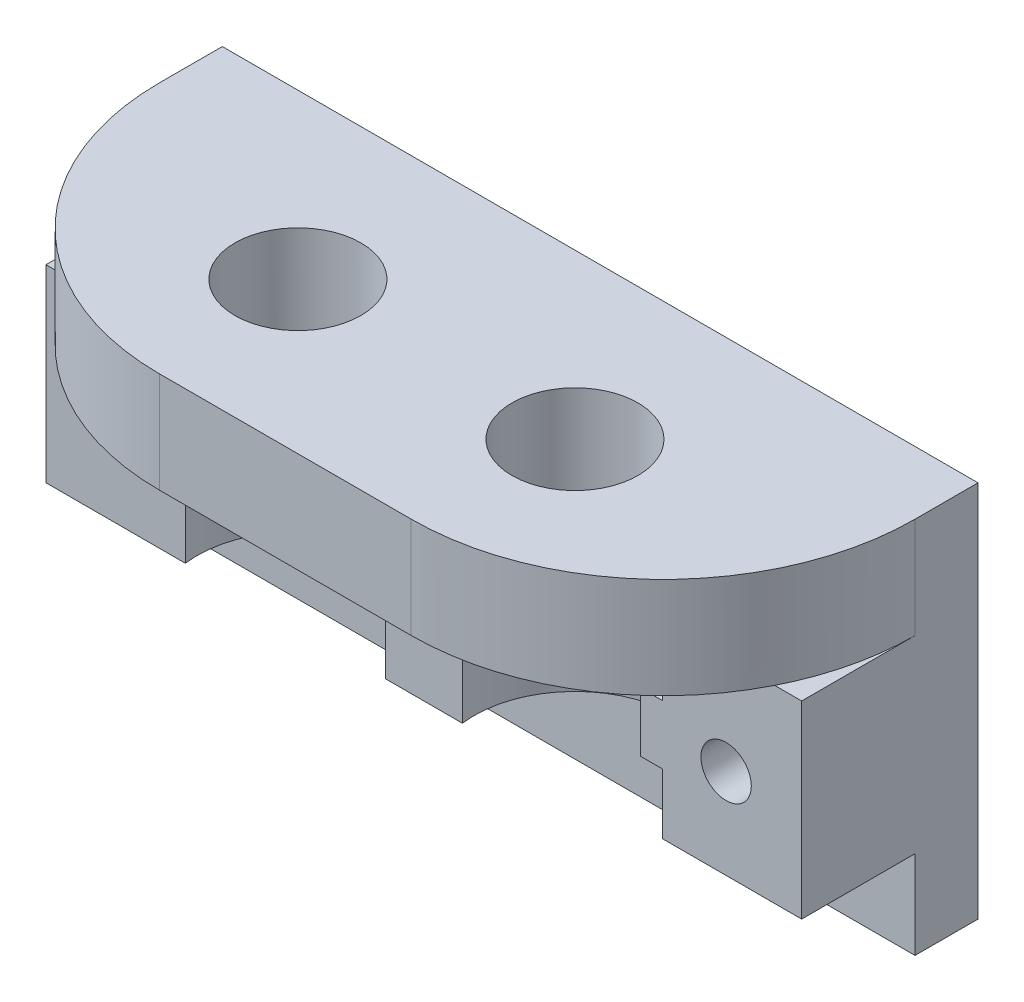
ISO-10303-21;
HEADER;
FILE_DESCRIPTION(('STEP AP214'),'2;1');
FILE_NAME('part.step','',(''),(''),'','','');
FILE_SCHEMA(('AUTOMOTIVE_DESIGN { 1 0 10303 214 1 1 1 1 }'));
ENDSEC;
DATA;
#1=APPLICATION_CONTEXT('core data for automotive mechanical design processes');
#2=APPLICATION_PROTOCOL_DEFINITION('international standard','automotive_design',2000,#1);
#3=PRODUCT_CONTEXT('',#1,'mechanical');
#4=PRODUCT('Part','Part','',(#3));
#5=PRODUCT_RELATED_PRODUCT_CATEGORY('part','',(#4));
#6=PRODUCT_DEFINITION_FORMATION('','',#4);
#7=PRODUCT_DEFINITION_CONTEXT('part definition',#1,'design');
#8=PRODUCT_DEFINITION('design','',#6,#7);
#9=PRODUCT_DEFINITION_SHAPE('','',#8);
#10=(LENGTH_UNIT() NAMED_UNIT(*) SI_UNIT(.MILLI.,.METRE.));
#11=(NAMED_UNIT(*) PLANE_ANGLE_UNIT() SI_UNIT($,.RADIAN.));
#12=(NAMED_UNIT(*) SI_UNIT($,.STERADIAN.) SOLID_ANGLE_UNIT());
#13=UNCERTAINTY_MEASURE_WITH_UNIT(LENGTH_MEASURE(1.E-05),#10,'distance_accuracy_value','');
#14=(GEOMETRIC_REPRESENTATION_CONTEXT(3) GLOBAL_UNCERTAINTY_ASSIGNED_CONTEXT((#13)) GLOBAL_UNIT_ASSIGNED_CONTEXT((#10,
#11,#12)) REPRESENTATION_CONTEXT('',''));
#15=CARTESIAN_POINT('',(0.,0.,0.));
#16=DIRECTION('',(0.,0.,1.));
#17=DIRECTION('',(1.,0.,0.));
#18=AXIS2_PLACEMENT_3D('',#15,#16,#17);
#19=CARTESIAN_POINT('',(-11.,7.,13.));
#20=DIRECTION('',(0.,-1.,0.));
#21=DIRECTION('',(0.,0.,-1.));
#22=AXIS2_PLACEMENT_3D('',#19,#20,#21);
#23=CYLINDRICAL_SURFACE('',#22,8.);
#24=DIRECTION('',(0.,-1.,0.));
#25=VECTOR('',#24,1.);
#26=CARTESIAN_POINT('',(-18.9372539331938,7.,14.));
#27=LINE('',#26,#25);
#28=CARTESIAN_POINT('',(-18.9372539331938,-8.,14.));
#29=VERTEX_POINT('',#28);
#30=CARTESIAN_POINT('',(-18.9372539331938,-3.2,14.));
#31=VERTEX_POINT('',#30);
#32=EDGE_CURVE('E466',#29,#31,#27,.F.);
#33=ORIENTED_EDGE('',*,*,#32,.F.);
#34=CARTESIAN_POINT('',(-11.,-8.,13.));
#35=DIRECTION('',(0.,-1.,0.));
#36=DIRECTION('',(0.,0.,-1.));
#37=AXIS2_PLACEMENT_3D('',#34,#35,#36);
#38=CIRCLE('',#37,8.);
#39=CARTESIAN_POINT('',(-11.,-8.,5.));
#40=VERTEX_POINT('',#39);
#41=EDGE_CURVE('E215',#29,#40,#38,.T.);
#42=ORIENTED_EDGE('',*,*,#41,.T.);
#43=CARTESIAN_POINT('',(-3.06274606680622,-8.,14.));
#44=VERTEX_POINT('',#43);
#45=EDGE_CURVE('E365',#40,#44,#38,.T.);
#46=ORIENTED_EDGE('',*,*,#45,.T.);
#47=DIRECTION('',(0.,-1.,0.));
#48=VECTOR('',#47,1.);
#49=CARTESIAN_POINT('',(-3.06274606680622,7.,14.));
#50=LINE('',#49,#48);
#51=CARTESIAN_POINT('',(-3.06274606680622,-3.2,14.));
#52=VERTEX_POINT('',#51);
#53=EDGE_CURVE('E453',#52,#44,#50,.T.);
#54=ORIENTED_EDGE('',*,*,#53,.F.);
#55=CARTESIAN_POINT('',(-11.,-3.2,13.));
#56=DIRECTION('',(0.,-1.,0.));
#57=DIRECTION('',(0.,0.,-1.));
#58=AXIS2_PLACEMENT_3D('',#55,#56,#57);
#59=CIRCLE('',#58,8.);
#60=EDGE_CURVE('E370',#52,#31,#59,.F.);
#61=ORIENTED_EDGE('',*,*,#60,.T.);
#62=EDGE_LOOP('',(#33,#42,#46,#54,#61));
#63=FACE_BOUND('',#62,.T.);
#64=ADVANCED_FACE('F34',(#63),#23,.F.);
#65=CARTESIAN_POINT('',(11.,7.,13.));
#66=DIRECTION('',(0.,-1.,0.));
#67=DIRECTION('',(0.,0.,-1.));
#68=AXIS2_PLACEMENT_3D('',#65,#66,#67);
#69=CYLINDRICAL_SURFACE('',#68,8.);
#70=DIRECTION('',(0.,-1.,0.));
#71=VECTOR('',#70,1.);
#72=CARTESIAN_POINT('',(3.06274606680622,7.,14.));
#73=LINE('',#72,#71);
#74=CARTESIAN_POINT('',(3.06274606680623,-8.,14.));
#75=VERTEX_POINT('',#74);
#76=CARTESIAN_POINT('',(3.06274606680622,-3.2,14.));
#77=VERTEX_POINT('',#76);
#78=EDGE_CURVE('E305',#75,#77,#73,.F.);
#79=ORIENTED_EDGE('',*,*,#78,.F.);
#80=CARTESIAN_POINT('',(11.,-8.,13.));
#81=DIRECTION('',(0.,-1.,0.));
#82=DIRECTION('',(0.,0.,1.));
#83=AXIS2_PLACEMENT_3D('',#80,#81,#82);
#84=CIRCLE('',#83,8.);
#85=CARTESIAN_POINT('',(11.,-8.,5.));
#86=VERTEX_POINT('',#85);
#87=EDGE_CURVE('E363',#75,#86,#84,.T.);
#88=ORIENTED_EDGE('',*,*,#87,.T.);
#89=CARTESIAN_POINT('',(18.9372539331938,-8.,14.));
#90=VERTEX_POINT('',#89);
#91=EDGE_CURVE('E367',#86,#90,#84,.T.);
#92=ORIENTED_EDGE('',*,*,#91,.T.);
#93=DIRECTION('',(0.,-1.,0.));
#94=VECTOR('',#93,1.);
#95=CARTESIAN_POINT('',(18.9372539331938,7.,14.));
#96=LINE('',#95,#94);
#97=CARTESIAN_POINT('',(18.9372539331938,-3.2,14.));
#98=VERTEX_POINT('',#97);
#99=EDGE_CURVE('E308',#98,#90,#96,.T.);
#100=ORIENTED_EDGE('',*,*,#99,.F.);
#101=CARTESIAN_POINT('',(11.,-3.2,13.));
#102=DIRECTION('',(0.,-1.,0.));
#103=DIRECTION('',(0.,0.,-1.));
#104=AXIS2_PLACEMENT_3D('',#101,#102,#103);
#105=CIRCLE('',#104,8.);
#106=EDGE_CURVE('E44',#98,#77,#105,.F.);
#107=ORIENTED_EDGE('',*,*,#106,.T.);
#108=EDGE_LOOP('',(#79,#88,#92,#100,#107));
#109=FACE_BOUND('',#108,.T.);
#110=ADVANCED_FACE('F304',(#109),#69,.F.);
#111=CARTESIAN_POINT('',(-30.,-8.,15.));
#112=DIRECTION('',(0.,1.,0.));
#113=DIRECTION('',(-1.,0.,0.));
#114=AXIS2_PLACEMENT_3D('',#111,#112,#113);
#115=PLANE('',#114);
#116=DIRECTION('',(1.,0.,0.));
#117=VECTOR('',#116,1.);
#118=CARTESIAN_POINT('',(-30.,-8.,14.));
#119=LINE('',#118,#117);
#120=CARTESIAN_POINT('',(30.,-8.,14.));
#121=VERTEX_POINT('',#120);
#122=EDGE_CURVE('E207',#90,#121,#119,.T.);
#123=ORIENTED_EDGE('',*,*,#122,.F.);
#124=ORIENTED_EDGE('',*,*,#91,.F.);
#125=DIRECTION('',(1.,0.,0.));
#126=VECTOR('',#125,1.);
#127=CARTESIAN_POINT('',(-30.,-8.,5.));
#128=LINE('',#127,#126);
#129=CARTESIAN_POINT('',(30.,-8.,5.));
#130=VERTEX_POINT('',#129);
#131=EDGE_CURVE('E374',#86,#130,#128,.T.);
#132=ORIENTED_EDGE('',*,*,#131,.T.);
#133=DIRECTION('',(0.,0.,-1.));
#134=VECTOR('',#133,1.);
#135=CARTESIAN_POINT('',(30.,-8.,15.));
#136=LINE('',#135,#134);
#137=EDGE_CURVE('E224',#121,#130,#136,.T.);
#138=ORIENTED_EDGE('',*,*,#137,.F.);
#139=EDGE_LOOP('',(#123,#124,#132,#138));
#140=FACE_BOUND('',#139,.T.);
#141=ADVANCED_FACE('F384',(#140),#115,.F.);
#142=EDGE_CURVE('E217',#44,#75,#119,.T.);
#143=ORIENTED_EDGE('',*,*,#142,.F.);
#144=ORIENTED_EDGE('',*,*,#45,.F.);
#145=EDGE_CURVE('E376',#40,#86,#128,.T.);
#146=ORIENTED_EDGE('',*,*,#145,.T.);
#147=ORIENTED_EDGE('',*,*,#87,.F.);
#148=EDGE_LOOP('',(#143,#144,#146,#147));
#149=FACE_BOUND('',#148,.T.);
#150=ADVANCED_FACE('F489',(#149),#115,.F.);
#151=CARTESIAN_POINT('',(30.,15.,5.));
#152=DIRECTION('',(-1.,0.,0.));
#153=DIRECTION('',(0.,-1.,0.));
#154=AXIS2_PLACEMENT_3D('',#151,#152,#153);
#155=PLANE('',#154);
#156=DIRECTION('',(0.,1.,0.));
#157=VECTOR('',#156,1.);
#158=CARTESIAN_POINT('',(30.,7.,14.));
#159=LINE('',#158,#157);
#160=CARTESIAN_POINT('',(30.,7.,14.));
#161=VERTEX_POINT('',#160);
#162=EDGE_CURVE('E216',#121,#161,#159,.T.);
#163=ORIENTED_EDGE('',*,*,#162,.F.);
#164=ORIENTED_EDGE('',*,*,#137,.T.);
#165=DIRECTION('',(0.,1.,0.));
#166=VECTOR('',#165,1.);
#167=CARTESIAN_POINT('',(30.,15.,5.));
#168=LINE('',#167,#166);
#169=CARTESIAN_POINT('',(30.,-15.,5.));
#170=VERTEX_POINT('',#169);
#171=EDGE_CURVE('E252',#170,#130,#168,.T.);
#172=ORIENTED_EDGE('',*,*,#171,.F.);
#173=DIRECTION('',(0.,0.,-1.));
#174=VECTOR('',#173,1.);
#175=CARTESIAN_POINT('',(30.,-15.,5.));
#176=LINE('',#175,#174);
#177=CARTESIAN_POINT('',(30.,-15.,0.));
#178=VERTEX_POINT('',#177);
#179=EDGE_CURVE('E396',#170,#178,#176,.T.);
#180=ORIENTED_EDGE('',*,*,#179,.T.);
#181=DIRECTION('',(0.,1.,0.));
#182=VECTOR('',#181,1.);
#183=CARTESIAN_POINT('',(30.,15.,0.));
#184=LINE('',#183,#182);
#185=CARTESIAN_POINT('',(30.,15.,0.));
#186=VERTEX_POINT('',#185);
#187=EDGE_CURVE('E246',#178,#186,#184,.T.);
#188=ORIENTED_EDGE('',*,*,#187,.T.);
#189=DIRECTION('',(0.,0.,-1.));
#190=VECTOR('',#189,1.);
#191=CARTESIAN_POINT('',(30.,15.,5.));
#192=LINE('',#191,#190);
#193=CARTESIAN_POINT('',(30.,15.,5.));
#194=VERTEX_POINT('',#193);
#195=EDGE_CURVE('E257',#194,#186,#192,.T.);
#196=ORIENTED_EDGE('',*,*,#195,.F.);
#197=DIRECTION('',(0.,1.,0.));
#198=VECTOR('',#197,1.);
#199=CARTESIAN_POINT('',(30.,7.,5.));
#200=LINE('',#199,#198);
#201=CARTESIAN_POINT('',(30.,7.,5.));
#202=VERTEX_POINT('',#201);
#203=EDGE_CURVE('E269',#194,#202,#200,.F.);
#204=ORIENTED_EDGE('',*,*,#203,.T.);
#205=DIRECTION('',(0.,0.,-1.));
#206=VECTOR('',#205,1.);
#207=CARTESIAN_POINT('',(30.,7.,15.));
#208=LINE('',#207,#206);
#209=EDGE_CURVE('E38',#161,#202,#208,.T.);
#210=ORIENTED_EDGE('',*,*,#209,.F.);
#211=EDGE_LOOP('',(#163,#164,#172,#180,#188,#196,#204,#210));
#212=FACE_BOUND('',#211,.T.);
#213=ADVANCED_FACE('F394',(#212),#155,.F.);
#214=CARTESIAN_POINT('',(-30.,15.,5.));
#215=DIRECTION('',(1.,0.,0.));
#216=DIRECTION('',(0.,1.,0.));
#217=AXIS2_PLACEMENT_3D('',#214,#215,#216);
#218=PLANE('',#217);
#219=DIRECTION('',(0.,-1.,0.));
#220=VECTOR('',#219,1.);
#221=CARTESIAN_POINT('',(-30.,7.,14.));
#222=LINE('',#221,#220);
#223=CARTESIAN_POINT('',(-30.,7.,14.));
#224=VERTEX_POINT('',#223);
#225=CARTESIAN_POINT('',(-30.,-8.,14.));
#226=VERTEX_POINT('',#225);
#227=EDGE_CURVE('E196',#224,#226,#222,.T.);
#228=ORIENTED_EDGE('',*,*,#227,.F.);
#229=DIRECTION('',(0.,0.,-1.));
#230=VECTOR('',#229,1.);
#231=CARTESIAN_POINT('',(-30.,7.,15.));
#232=LINE('',#231,#230);
#233=CARTESIAN_POINT('',(-30.,7.,5.));
#234=VERTEX_POINT('',#233);
#235=EDGE_CURVE('E287',#224,#234,#232,.T.);
#236=ORIENTED_EDGE('',*,*,#235,.T.);
#237=DIRECTION('',(0.,-1.,0.));
#238=VECTOR('',#237,1.);
#239=CARTESIAN_POINT('',(-30.,15.,5.));
#240=LINE('',#239,#238);
#241=CARTESIAN_POINT('',(-30.,15.,5.));
#242=VERTEX_POINT('',#241);
#243=EDGE_CURVE('E298',#234,#242,#240,.F.);
#244=ORIENTED_EDGE('',*,*,#243,.T.);
#245=DIRECTION('',(0.,0.,-1.));
#246=VECTOR('',#245,1.);
#247=CARTESIAN_POINT('',(-30.,15.,5.));
#248=LINE('',#247,#246);
#249=CARTESIAN_POINT('',(-30.,15.,0.));
#250=VERTEX_POINT('',#249);
#251=EDGE_CURVE('E421',#242,#250,#248,.T.);
#252=ORIENTED_EDGE('',*,*,#251,.T.);
#253=DIRECTION('',(0.,-1.,0.));
#254=VECTOR('',#253,1.);
#255=CARTESIAN_POINT('',(-30.,15.,0.));
#256=LINE('',#255,#254);
#257=CARTESIAN_POINT('',(-30.,-15.,0.));
#258=VERTEX_POINT('',#257);
#259=EDGE_CURVE('E429',#250,#258,#256,.T.);
#260=ORIENTED_EDGE('',*,*,#259,.T.);
#261=DIRECTION('',(0.,0.,-1.));
#262=VECTOR('',#261,1.);
#263=CARTESIAN_POINT('',(-30.,-15.,5.));
#264=LINE('',#263,#262);
#265=CARTESIAN_POINT('',(-30.,-15.,5.));
#266=VERTEX_POINT('',#265);
#267=EDGE_CURVE('E422',#266,#258,#264,.T.);
#268=ORIENTED_EDGE('',*,*,#267,.F.);
#269=DIRECTION('',(0.,-1.,0.));
#270=VECTOR('',#269,1.);
#271=CARTESIAN_POINT('',(-30.,15.,5.));
#272=LINE('',#271,#270);
#273=CARTESIAN_POINT('',(-30.,-8.,5.));
#274=VERTEX_POINT('',#273);
#275=EDGE_CURVE('E222',#274,#266,#272,.T.);
#276=ORIENTED_EDGE('',*,*,#275,.F.);
#277=DIRECTION('',(0.,0.,-1.));
#278=VECTOR('',#277,1.);
#279=CARTESIAN_POINT('',(-30.,-8.,15.));
#280=LINE('',#279,#278);
#281=EDGE_CURVE('E213',#226,#274,#280,.T.);
#282=ORIENTED_EDGE('',*,*,#281,.F.);
#283=EDGE_LOOP('',(#228,#236,#244,#252,#260,#268,#276,#282));
#284=FACE_BOUND('',#283,.T.);
#285=ADVANCED_FACE('F220',(#284),#218,.F.);
#286=CARTESIAN_POINT('',(-30.,7.,15.));
#287=DIRECTION('',(0.,-1.,0.));
#288=DIRECTION('',(0.,0.,-1.));
#289=AXIS2_PLACEMENT_3D('',#286,#287,#288);
#290=PLANE('',#289);
#291=DIRECTION('',(-1.,0.,0.));
#292=VECTOR('',#291,1.);
#293=CARTESIAN_POINT('',(-30.,7.,14.));
#294=LINE('',#293,#292);
#295=CARTESIAN_POINT('',(27.8605710994918,7.,14.));
#296=VERTEX_POINT('',#295);
#297=EDGE_CURVE('E337',#161,#296,#294,.T.);
#298=ORIENTED_EDGE('',*,*,#297,.F.);
#299=ORIENTED_EDGE('',*,*,#209,.T.);
#300=CARTESIAN_POINT('',(9.99999999999999,7.,5.));
#301=DIRECTION('',(0.,1.,0.));
#302=DIRECTION('',(0.,0.,1.));
#303=AXIS2_PLACEMENT_3D('',#300,#301,#302);
#304=CIRCLE('',#303,20.);
#305=EDGE_CURVE('E280',#202,#296,#304,.F.);
#306=ORIENTED_EDGE('',*,*,#305,.T.);
#307=EDGE_LOOP('',(#298,#299,#306));
#308=FACE_BOUND('',#307,.T.);
#309=ADVANCED_FACE('F403',(#308),#290,.F.);
#310=EDGE_CURVE('E199',#226,#29,#119,.T.);
#311=ORIENTED_EDGE('',*,*,#310,.F.);
#312=ORIENTED_EDGE('',*,*,#281,.T.);
#313=EDGE_CURVE('E289',#274,#40,#128,.T.);
#314=ORIENTED_EDGE('',*,*,#313,.T.);
#315=ORIENTED_EDGE('',*,*,#41,.F.);
#316=EDGE_LOOP('',(#311,#312,#314,#315));
#317=FACE_BOUND('',#316,.T.);
#318=ADVANCED_FACE('F211',(#317),#115,.F.);
#319=CARTESIAN_POINT('',(-27.8605710994918,7.,14.));
#320=VERTEX_POINT('',#319);
#321=EDGE_CURVE('E203',#320,#224,#294,.T.);
#322=ORIENTED_EDGE('',*,*,#321,.F.);
#323=CARTESIAN_POINT('',(-10.,7.,5.));
#324=DIRECTION('',(0.,1.,0.));
#325=DIRECTION('',(0.,0.,1.));
#326=AXIS2_PLACEMENT_3D('',#323,#324,#325);
#327=CIRCLE('',#326,20.);
#328=EDGE_CURVE('E272',#320,#234,#327,.F.);
#329=ORIENTED_EDGE('',*,*,#328,.T.);
#330=ORIENTED_EDGE('',*,*,#235,.F.);
#331=EDGE_LOOP('',(#322,#329,#330));
#332=FACE_BOUND('',#331,.T.);
#333=ADVANCED_FACE('F528',(#332),#290,.F.);
#334=DIRECTION('',(0.,-1.,0.));
#335=VECTOR('',#334,1.);
#336=CARTESIAN_POINT('',(-18.9372539331938,7.,14.));
#337=LINE('',#336,#335);
#338=CARTESIAN_POINT('',(-18.9372539331938,1.5,14.));
#339=VERTEX_POINT('',#338);
#340=CARTESIAN_POINT('',(-18.9372539331938,7.,14.));
#341=VERTEX_POINT('',#340);
#342=EDGE_CURVE('E448',#339,#341,#337,.F.);
#343=ORIENTED_EDGE('',*,*,#342,.F.);
#344=CARTESIAN_POINT('',(-11.,1.5,13.));
#345=DIRECTION('',(0.,1.,0.));
#346=DIRECTION('',(0.,0.,1.));
#347=AXIS2_PLACEMENT_3D('',#344,#345,#346);
#348=CIRCLE('',#347,8.);
#349=CARTESIAN_POINT('',(-3.06274606680622,1.5,14.));
#350=VERTEX_POINT('',#349);
#351=EDGE_CURVE('E451',#339,#350,#348,.F.);
#352=ORIENTED_EDGE('',*,*,#351,.T.);
#353=DIRECTION('',(0.,-1.,0.));
#354=VECTOR('',#353,1.);
#355=CARTESIAN_POINT('',(-3.06274606680622,7.,14.));
#356=LINE('',#355,#354);
#357=CARTESIAN_POINT('',(-3.06274606680622,7.,14.));
#358=VERTEX_POINT('',#357);
#359=EDGE_CURVE('E450',#358,#350,#356,.T.);
#360=ORIENTED_EDGE('',*,*,#359,.F.);
#361=CARTESIAN_POINT('',(-11.,7.,13.));
#362=DIRECTION('',(0.,-1.,0.));
#363=DIRECTION('',(0.,0.,-1.));
#364=AXIS2_PLACEMENT_3D('',#361,#362,#363);
#365=CIRCLE('',#364,8.);
#366=EDGE_CURVE('E373',#341,#358,#365,.T.);
#367=ORIENTED_EDGE('',*,*,#366,.F.);
#368=EDGE_LOOP('',(#343,#352,#360,#367));
#369=FACE_BOUND('',#368,.T.);
#370=ADVANCED_FACE('F446',(#369),#23,.F.);
#371=DIRECTION('',(0.,-1.,0.));
#372=VECTOR('',#371,1.);
#373=CARTESIAN_POINT('',(3.06274606680622,7.,14.));
#374=LINE('',#373,#372);
#375=CARTESIAN_POINT('',(3.06274606680622,1.5,14.));
#376=VERTEX_POINT('',#375);
#377=CARTESIAN_POINT('',(3.06274606680623,7.,14.));
#378=VERTEX_POINT('',#377);
#379=EDGE_CURVE('E320',#376,#378,#374,.F.);
#380=ORIENTED_EDGE('',*,*,#379,.F.);
#381=CARTESIAN_POINT('',(11.,1.5,13.));
#382=DIRECTION('',(0.,1.,0.));
#383=DIRECTION('',(0.,0.,1.));
#384=AXIS2_PLACEMENT_3D('',#381,#382,#383);
#385=CIRCLE('',#384,8.);
#386=CARTESIAN_POINT('',(18.9372539331938,1.5,14.));
#387=VERTEX_POINT('',#386);
#388=EDGE_CURVE('E295',#376,#387,#385,.F.);
#389=ORIENTED_EDGE('',*,*,#388,.T.);
#390=DIRECTION('',(0.,-1.,0.));
#391=VECTOR('',#390,1.);
#392=CARTESIAN_POINT('',(18.9372539331938,7.,14.));
#393=LINE('',#392,#391);
#394=CARTESIAN_POINT('',(18.9372539331938,7.,14.));
#395=VERTEX_POINT('',#394);
#396=EDGE_CURVE('E327',#395,#387,#393,.T.);
#397=ORIENTED_EDGE('',*,*,#396,.F.);
#398=CARTESIAN_POINT('',(11.,7.,13.));
#399=DIRECTION('',(0.,-1.,0.));
#400=DIRECTION('',(0.,0.,1.));
#401=AXIS2_PLACEMENT_3D('',#398,#399,#400);
#402=CIRCLE('',#401,8.);
#403=EDGE_CURVE('E358',#378,#395,#402,.T.);
#404=ORIENTED_EDGE('',*,*,#403,.F.);
#405=EDGE_LOOP('',(#380,#389,#397,#404));
#406=FACE_BOUND('',#405,.T.);
#407=ADVANCED_FACE('F357',(#406),#69,.F.);
#408=CARTESIAN_POINT('',(-30.,1.5,-55.1838018074631));
#409=DIRECTION('',(0.,1.,0.));
#410=DIRECTION('',(0.,0.,1.));
#411=AXIS2_PLACEMENT_3D('',#408,#409,#410);
#412=PLANE('',#411);
#413=ORIENTED_EDGE('',*,*,#388,.F.);
#414=DIRECTION('',(1.,0.,0.));
#415=VECTOR('',#414,1.);
#416=CARTESIAN_POINT('',(-30.,1.5,14.));
#417=LINE('',#416,#415);
#418=CARTESIAN_POINT('',(4.7798713839664,1.5,14.));
#419=VERTEX_POINT('',#418);
#420=EDGE_CURVE('E316',#376,#419,#417,.T.);
#421=ORIENTED_EDGE('',*,*,#420,.T.);
#422=CARTESIAN_POINT('',(11.,1.5,13.));
#423=DIRECTION('',(0.,1.,0.));
#424=DIRECTION('',(0.,0.,1.));
#425=AXIS2_PLACEMENT_3D('',#422,#423,#424);
#426=CIRCLE('',#425,6.3);
#427=CARTESIAN_POINT('',(17.2201286160336,1.5,14.));
#428=VERTEX_POINT('',#427);
#429=EDGE_CURVE('E478',#428,#419,#426,.T.);
#430=ORIENTED_EDGE('',*,*,#429,.F.);
#431=EDGE_CURVE('E322',#428,#387,#417,.T.);
#432=ORIENTED_EDGE('',*,*,#431,.T.);
#433=EDGE_LOOP('',(#413,#421,#430,#432));
#434=FACE_BOUND('',#433,.T.);
#435=ADVANCED_FACE('F509',(#434),#412,.T.);
#436=CARTESIAN_POINT('',(-30.,-3.2,-55.1838018074631));
#437=DIRECTION('',(0.,-1.,0.));
#438=DIRECTION('',(0.,0.,-1.));
#439=AXIS2_PLACEMENT_3D('',#436,#437,#438);
#440=PLANE('',#439);
#441=ORIENTED_EDGE('',*,*,#106,.F.);
#442=DIRECTION('',(-1.,0.,0.));
#443=VECTOR('',#442,1.);
#444=CARTESIAN_POINT('',(-30.,-3.2,14.));
#445=LINE('',#444,#443);
#446=CARTESIAN_POINT('',(17.2201286160336,-3.2,14.));
#447=VERTEX_POINT('',#446);
#448=EDGE_CURVE('E313',#98,#447,#445,.T.);
#449=ORIENTED_EDGE('',*,*,#448,.T.);
#450=CARTESIAN_POINT('',(11.,-3.2,13.));
#451=DIRECTION('',(0.,-1.,0.));
#452=DIRECTION('',(0.,0.,1.));
#453=AXIS2_PLACEMENT_3D('',#450,#451,#452);
#454=CIRCLE('',#453,6.3);
#455=CARTESIAN_POINT('',(4.7798713839664,-3.2,14.));
#456=VERTEX_POINT('',#455);
#457=EDGE_CURVE('E315',#456,#447,#454,.T.);
#458=ORIENTED_EDGE('',*,*,#457,.F.);
#459=EDGE_CURVE('E60',#456,#77,#445,.T.);
#460=ORIENTED_EDGE('',*,*,#459,.T.);
#461=EDGE_LOOP('',(#441,#449,#458,#460));
#462=FACE_BOUND('',#461,.T.);
#463=ADVANCED_FACE('F311',(#462),#440,.T.);
#464=ORIENTED_EDGE('',*,*,#60,.F.);
#465=DIRECTION('',(-1.,0.,0.));
#466=VECTOR('',#465,1.);
#467=CARTESIAN_POINT('',(-30.,-3.2,14.));
#468=LINE('',#467,#466);
#469=CARTESIAN_POINT('',(-4.7798713839664,-3.2,14.));
#470=VERTEX_POINT('',#469);
#471=EDGE_CURVE('E454',#52,#470,#468,.T.);
#472=ORIENTED_EDGE('',*,*,#471,.T.);
#473=CARTESIAN_POINT('',(-11.,-3.2,13.));
#474=DIRECTION('',(0.,-1.,0.));
#475=DIRECTION('',(0.,0.,-1.));
#476=AXIS2_PLACEMENT_3D('',#473,#474,#475);
#477=CIRCLE('',#476,6.3);
#478=CARTESIAN_POINT('',(-17.2201286160336,-3.2,14.));
#479=VERTEX_POINT('',#478);
#480=EDGE_CURVE('E481',#479,#470,#477,.T.);
#481=ORIENTED_EDGE('',*,*,#480,.F.);
#482=EDGE_CURVE('E52',#479,#31,#468,.T.);
#483=ORIENTED_EDGE('',*,*,#482,.T.);
#484=EDGE_LOOP('',(#464,#472,#481,#483));
#485=FACE_BOUND('',#484,.T.);
#486=ADVANCED_FACE('F493',(#485),#440,.T.);
#487=ORIENTED_EDGE('',*,*,#351,.F.);
#488=DIRECTION('',(1.,0.,0.));
#489=VECTOR('',#488,1.);
#490=CARTESIAN_POINT('',(-30.,1.5,14.));
#491=LINE('',#490,#489);
#492=CARTESIAN_POINT('',(-17.2201286160336,1.5,14.));
#493=VERTEX_POINT('',#492);
#494=EDGE_CURVE('E464',#339,#493,#491,.T.);
#495=ORIENTED_EDGE('',*,*,#494,.T.);
#496=CARTESIAN_POINT('',(-11.,1.5,13.));
#497=DIRECTION('',(0.,1.,0.));
#498=DIRECTION('',(0.,0.,1.));
#499=AXIS2_PLACEMENT_3D('',#496,#497,#498);
#500=CIRCLE('',#499,6.3);
#501=CARTESIAN_POINT('',(-4.7798713839664,1.5,14.));
#502=VERTEX_POINT('',#501);
#503=EDGE_CURVE('E11',#502,#493,#500,.T.);
#504=ORIENTED_EDGE('',*,*,#503,.F.);
#505=EDGE_CURVE('E459',#502,#350,#491,.T.);
#506=ORIENTED_EDGE('',*,*,#505,.T.);
#507=EDGE_LOOP('',(#487,#495,#504,#506));
#508=FACE_BOUND('',#507,.T.);
#509=ADVANCED_FACE('F506',(#508),#412,.T.);
#510=CARTESIAN_POINT('',(-11.,1.8,13.));
#511=DIRECTION('',(0.,-1.,0.));
#512=DIRECTION('',(0.,0.,-1.));
#513=AXIS2_PLACEMENT_3D('',#510,#511,#512);
#514=CYLINDRICAL_SURFACE('',#513,6.3);
#515=DIRECTION('',(0.,-1.,0.));
#516=VECTOR('',#515,1.);
#517=CARTESIAN_POINT('',(-17.2201286160336,1.8,14.));
#518=LINE('',#517,#516);
#519=EDGE_CURVE('E456',#479,#493,#518,.F.);
#520=ORIENTED_EDGE('',*,*,#519,.F.);
#521=ORIENTED_EDGE('',*,*,#480,.T.);
#522=DIRECTION('',(0.,-1.,0.));
#523=VECTOR('',#522,1.);
#524=CARTESIAN_POINT('',(-4.7798713839664,1.8,14.));
#525=LINE('',#524,#523);
#526=EDGE_CURVE('E498',#502,#470,#525,.T.);
#527=ORIENTED_EDGE('',*,*,#526,.F.);
#528=ORIENTED_EDGE('',*,*,#503,.T.);
#529=EDGE_LOOP('',(#520,#521,#527,#528));
#530=FACE_BOUND('',#529,.T.);
#531=ADVANCED_FACE('F505',(#530),#514,.F.);
#532=CARTESIAN_POINT('',(11.,1.8,13.));
#533=DIRECTION('',(0.,-1.,0.));
#534=DIRECTION('',(0.,0.,-1.));
#535=AXIS2_PLACEMENT_3D('',#532,#533,#534);
#536=CYLINDRICAL_SURFACE('',#535,6.3);
#537=DIRECTION('',(0.,-1.,0.));
#538=VECTOR('',#537,1.);
#539=CARTESIAN_POINT('',(4.7798713839664,1.8,14.));
#540=LINE('',#539,#538);
#541=EDGE_CURVE('E317',#456,#419,#540,.F.);
#542=ORIENTED_EDGE('',*,*,#541,.F.);
#543=ORIENTED_EDGE('',*,*,#457,.T.);
#544=DIRECTION('',(0.,-1.,0.));
#545=VECTOR('',#544,1.);
#546=CARTESIAN_POINT('',(17.2201286160336,1.8,14.));
#547=LINE('',#546,#545);
#548=EDGE_CURVE('E325',#428,#447,#547,.T.);
#549=ORIENTED_EDGE('',*,*,#548,.F.);
#550=ORIENTED_EDGE('',*,*,#429,.T.);
#551=EDGE_LOOP('',(#542,#543,#549,#550));
#552=FACE_BOUND('',#551,.T.);
#553=ADVANCED_FACE('F514',(#552),#536,.F.);
#554=CARTESIAN_POINT('',(0.,-0.850000000000002,0.));
#555=DIRECTION('',(0.,0.,1.));
#556=DIRECTION('',(1.,0.,0.));
#557=AXIS2_PLACEMENT_3D('',#554,#555,#556);
#558=CYLINDRICAL_SURFACE('',#557,2.);
#559=CARTESIAN_POINT('',(0.,-0.850000000000002,0.));
#560=DIRECTION('',(0.,0.,1.));
#561=DIRECTION('',(1.,0.,0.));
#562=AXIS2_PLACEMENT_3D('',#559,#560,#561);
#563=CIRCLE('',#562,2.);
#564=CARTESIAN_POINT('',(2.,-0.850000000000002,0.));
#565=VERTEX_POINT('',#564);
#566=EDGE_CURVE('E474',#565,#565,#563,.T.);
#567=ORIENTED_EDGE('',*,*,#566,.F.);
#568=EDGE_LOOP('',(#567));
#569=FACE_BOUND('',#568,.T.);
#570=CARTESIAN_POINT('',(0.,-0.850000000000002,14.));
#571=DIRECTION('',(0.,0.,1.));
#572=DIRECTION('',(1.,0.,0.));
#573=AXIS2_PLACEMENT_3D('',#570,#571,#572);
#574=CIRCLE('',#573,2.);
#575=CARTESIAN_POINT('',(2.,-0.850000000000002,14.));
#576=VERTEX_POINT('',#575);
#577=EDGE_CURVE('E328',#576,#576,#574,.F.);
#578=ORIENTED_EDGE('',*,*,#577,.F.);
#579=EDGE_LOOP('',(#578));
#580=FACE_BOUND('',#579,.T.);
#581=ADVANCED_FACE('F585',(#569,#580),#558,.F.);
#582=CARTESIAN_POINT('',(24.,-0.850000000000002,0.));
#583=DIRECTION('',(0.,0.,1.));
#584=DIRECTION('',(1.,0.,0.));
#585=AXIS2_PLACEMENT_3D('',#582,#583,#584);
#586=CYLINDRICAL_SURFACE('',#585,2.);
#587=CARTESIAN_POINT('',(24.,-0.850000000000002,0.));
#588=DIRECTION('',(0.,0.,1.));
#589=DIRECTION('',(1.,0.,0.));
#590=AXIS2_PLACEMENT_3D('',#587,#588,#589);
#591=CIRCLE('',#590,2.);
#592=CARTESIAN_POINT('',(26.,-0.850000000000002,0.));
#593=VERTEX_POINT('',#592);
#594=EDGE_CURVE('E471',#593,#593,#591,.T.);
#595=ORIENTED_EDGE('',*,*,#594,.F.);
#596=EDGE_LOOP('',(#595));
#597=FACE_BOUND('',#596,.T.);
#598=CARTESIAN_POINT('',(24.,-0.850000000000002,14.));
#599=DIRECTION('',(0.,0.,1.));
#600=DIRECTION('',(1.,0.,0.));
#601=AXIS2_PLACEMENT_3D('',#598,#599,#600);
#602=CIRCLE('',#601,2.);
#603=CARTESIAN_POINT('',(26.,-0.850000000000002,14.));
#604=VERTEX_POINT('',#603);
#605=EDGE_CURVE('E332',#604,#604,#602,.F.);
#606=ORIENTED_EDGE('',*,*,#605,.F.);
#607=EDGE_LOOP('',(#606));
#608=FACE_BOUND('',#607,.T.);
#609=ADVANCED_FACE('F588',(#597,#608),#586,.F.);
#610=CARTESIAN_POINT('',(-24.,-0.850000000000002,0.));
#611=DIRECTION('',(0.,0.,1.));
#612=DIRECTION('',(1.,0.,0.));
#613=AXIS2_PLACEMENT_3D('',#610,#611,#612);
#614=CYLINDRICAL_SURFACE('',#613,2.);
#615=CARTESIAN_POINT('',(-24.,-0.850000000000002,0.));
#616=DIRECTION('',(0.,0.,1.));
#617=DIRECTION('',(1.,0.,0.));
#618=AXIS2_PLACEMENT_3D('',#615,#616,#617);
#619=CIRCLE('',#618,2.);
#620=CARTESIAN_POINT('',(-22.,-0.850000000000002,0.));
#621=VERTEX_POINT('',#620);
#622=EDGE_CURVE('E468',#621,#621,#619,.T.);
#623=ORIENTED_EDGE('',*,*,#622,.F.);
#624=EDGE_LOOP('',(#623));
#625=FACE_BOUND('',#624,.T.);
#626=CARTESIAN_POINT('',(-24.,-0.850000000000002,14.));
#627=DIRECTION('',(0.,0.,1.));
#628=DIRECTION('',(1.,0.,0.));
#629=AXIS2_PLACEMENT_3D('',#626,#627,#628);
#630=CIRCLE('',#629,2.);
#631=CARTESIAN_POINT('',(-22.,-0.850000000000002,14.));
#632=VERTEX_POINT('',#631);
#633=EDGE_CURVE('E286',#632,#632,#630,.F.);
#634=ORIENTED_EDGE('',*,*,#633,.F.);
#635=EDGE_LOOP('',(#634));
#636=FACE_BOUND('',#635,.T.);
#637=ADVANCED_FACE('F574',(#625,#636),#614,.F.);
#638=CARTESIAN_POINT('',(0.,0.,5.));
#639=DIRECTION('',(0.,0.,1.));
#640=DIRECTION('',(1.,0.,0.));
#641=AXIS2_PLACEMENT_3D('',#638,#639,#640);
#642=PLANE('',#641);
#643=ORIENTED_EDGE('',*,*,#171,.T.);
#644=ORIENTED_EDGE('',*,*,#131,.F.);
#645=ORIENTED_EDGE('',*,*,#145,.F.);
#646=ORIENTED_EDGE('',*,*,#313,.F.);
#647=ORIENTED_EDGE('',*,*,#275,.T.);
#648=DIRECTION('',(1.,0.,0.));
#649=VECTOR('',#648,1.);
#650=CARTESIAN_POINT('',(-30.,-15.,5.));
#651=LINE('',#650,#649);
#652=EDGE_CURVE('E390',#266,#170,#651,.T.);
#653=ORIENTED_EDGE('',*,*,#652,.T.);
#654=EDGE_LOOP('',(#643,#644,#645,#646,#647,#653));
#655=FACE_BOUND('',#654,.T.);
#656=ADVANCED_FACE('F388',(#655),#642,.T.);
#657=CARTESIAN_POINT('',(-30.,7.,25.));
#658=DIRECTION('',(0.,1.,0.));
#659=DIRECTION('',(0.,0.,1.));
#660=AXIS2_PLACEMENT_3D('',#657,#658,#659);
#661=PLANE('',#660);
#662=CARTESIAN_POINT('',(-11.,7.,13.));
#663=DIRECTION('',(0.,1.,0.));
#664=DIRECTION('',(0.,0.,1.));
#665=AXIS2_PLACEMENT_3D('',#662,#663,#664);
#666=CIRCLE('',#665,5.);
#667=CARTESIAN_POINT('',(-11.,7.,18.));
#668=VERTEX_POINT('',#667);
#669=EDGE_CURVE('E227',#668,#668,#666,.F.);
#670=ORIENTED_EDGE('',*,*,#669,.F.);
#671=EDGE_LOOP('',(#670));
#672=FACE_BOUND('',#671,.T.);
#673=CARTESIAN_POINT('',(11.,7.,13.));
#674=DIRECTION('',(0.,1.,0.));
#675=DIRECTION('',(0.,0.,1.));
#676=AXIS2_PLACEMENT_3D('',#673,#674,#675);
#677=CIRCLE('',#676,5.);
#678=CARTESIAN_POINT('',(11.,7.,18.));
#679=VERTEX_POINT('',#678);
#680=EDGE_CURVE('E237',#679,#679,#677,.F.);
#681=ORIENTED_EDGE('',*,*,#680,.F.);
#682=EDGE_LOOP('',(#681));
#683=FACE_BOUND('',#682,.T.);
#684=EDGE_CURVE('E343',#341,#320,#294,.T.);
#685=ORIENTED_EDGE('',*,*,#684,.F.);
#686=ORIENTED_EDGE('',*,*,#366,.T.);
#687=EDGE_CURVE('E344',#378,#358,#294,.T.);
#688=ORIENTED_EDGE('',*,*,#687,.F.);
#689=ORIENTED_EDGE('',*,*,#403,.T.);
#690=EDGE_CURVE('E340',#296,#395,#294,.T.);
#691=ORIENTED_EDGE('',*,*,#690,.F.);
#692=CARTESIAN_POINT('',(9.99999999999999,7.,25.));
#693=VERTEX_POINT('',#692);
#694=EDGE_CURVE('E277',#296,#693,#304,.F.);
#695=ORIENTED_EDGE('',*,*,#694,.T.);
#696=DIRECTION('',(1.,0.,0.));
#697=VECTOR('',#696,1.);
#698=CARTESIAN_POINT('',(-30.,7.,25.));
#699=LINE('',#698,#697);
#700=CARTESIAN_POINT('',(-10.,7.,25.));
#701=VERTEX_POINT('',#700);
#702=EDGE_CURVE('E240',#701,#693,#699,.T.);
#703=ORIENTED_EDGE('',*,*,#702,.F.);
#704=EDGE_CURVE('E275',#701,#320,#327,.F.);
#705=ORIENTED_EDGE('',*,*,#704,.T.);
#706=EDGE_LOOP('',(#685,#686,#688,#689,#691,#695,#703,#705));
#707=FACE_BOUND('',#706,.T.);
#708=ADVANCED_FACE('F361',(#672,#683,#707),#661,.F.);
#709=CARTESIAN_POINT('',(-30.,15.,5.));
#710=DIRECTION('',(0.,-1.,0.));
#711=DIRECTION('',(0.,0.,-1.));
#712=AXIS2_PLACEMENT_3D('',#709,#710,#711);
#713=PLANE('',#712);
#714=CARTESIAN_POINT('',(-11.,15.,13.));
#715=DIRECTION('',(0.,1.,0.));
#716=DIRECTION('',(0.,0.,-1.));
#717=AXIS2_PLACEMENT_3D('',#714,#715,#716);
#718=CIRCLE('',#717,5.);
#719=CARTESIAN_POINT('',(-11.,15.,8.));
#720=VERTEX_POINT('',#719);
#721=EDGE_CURVE('E223',#720,#720,#718,.T.);
#722=ORIENTED_EDGE('',*,*,#721,.F.);
#723=EDGE_LOOP('',(#722));
#724=FACE_BOUND('',#723,.T.);
#725=CARTESIAN_POINT('',(11.,15.,13.));
#726=DIRECTION('',(0.,1.,0.));
#727=DIRECTION('',(0.,0.,1.));
#728=AXIS2_PLACEMENT_3D('',#725,#726,#727);
#729=CIRCLE('',#728,5.);
#730=CARTESIAN_POINT('',(11.,15.,18.));
#731=VERTEX_POINT('',#730);
#732=EDGE_CURVE('E234',#731,#731,#729,.T.);
#733=ORIENTED_EDGE('',*,*,#732,.F.);
#734=EDGE_LOOP('',(#733));
#735=FACE_BOUND('',#734,.T.);
#736=DIRECTION('',(-1.,0.,0.));
#737=VECTOR('',#736,1.);
#738=CARTESIAN_POINT('',(-30.,15.,25.));
#739=LINE('',#738,#737);
#740=CARTESIAN_POINT('',(9.99999999999999,15.,25.));
#741=VERTEX_POINT('',#740);
#742=CARTESIAN_POINT('',(-10.,15.,25.));
#743=VERTEX_POINT('',#742);
#744=EDGE_CURVE('E243',#741,#743,#739,.T.);
#745=ORIENTED_EDGE('',*,*,#744,.F.);
#746=CARTESIAN_POINT('',(9.99999999999999,15.,5.));
#747=DIRECTION('',(0.,-1.,0.));
#748=DIRECTION('',(0.,0.,-1.));
#749=AXIS2_PLACEMENT_3D('',#746,#747,#748);
#750=CIRCLE('',#749,20.);
#751=EDGE_CURVE('E267',#741,#194,#750,.F.);
#752=ORIENTED_EDGE('',*,*,#751,.T.);
#753=ORIENTED_EDGE('',*,*,#195,.T.);
#754=DIRECTION('',(-1.,0.,0.));
#755=VECTOR('',#754,1.);
#756=CARTESIAN_POINT('',(-30.,15.,0.));
#757=LINE('',#756,#755);
#758=EDGE_CURVE('E431',#186,#250,#757,.T.);
#759=ORIENTED_EDGE('',*,*,#758,.T.);
#760=ORIENTED_EDGE('',*,*,#251,.F.);
#761=CARTESIAN_POINT('',(-10.,15.,5.));
#762=DIRECTION('',(0.,-1.,0.));
#763=DIRECTION('',(0.,0.,-1.));
#764=AXIS2_PLACEMENT_3D('',#761,#762,#763);
#765=CIRCLE('',#764,20.);
#766=EDGE_CURVE('E265',#242,#743,#765,.F.);
#767=ORIENTED_EDGE('',*,*,#766,.T.);
#768=EDGE_LOOP('',(#745,#752,#753,#759,#760,#767));
#769=FACE_BOUND('',#768,.T.);
#770=ADVANCED_FACE('F418',(#724,#735,#769),#713,.F.);
#771=CARTESIAN_POINT('',(-30.,-15.,5.));
#772=DIRECTION('',(0.,1.,0.));
#773=DIRECTION('',(0.,0.,1.));
#774=AXIS2_PLACEMENT_3D('',#771,#772,#773);
#775=PLANE('',#774);
#776=DIRECTION('',(1.,0.,0.));
#777=VECTOR('',#776,1.);
#778=CARTESIAN_POINT('',(-30.,-15.,0.));
#779=LINE('',#778,#777);
#780=EDGE_CURVE('E256',#258,#178,#779,.T.);
#781=ORIENTED_EDGE('',*,*,#780,.T.);
#782=ORIENTED_EDGE('',*,*,#179,.F.);
#783=ORIENTED_EDGE('',*,*,#652,.F.);
#784=ORIENTED_EDGE('',*,*,#267,.T.);
#785=EDGE_LOOP('',(#781,#782,#783,#784));
#786=FACE_BOUND('',#785,.T.);
#787=ADVANCED_FACE('F436',(#786),#775,.F.);
#788=CARTESIAN_POINT('',(0.,0.,0.));
#789=DIRECTION('',(0.,0.,1.));
#790=DIRECTION('',(1.,0.,0.));
#791=AXIS2_PLACEMENT_3D('',#788,#789,#790);
#792=PLANE('',#791);
#793=ORIENTED_EDGE('',*,*,#622,.T.);
#794=EDGE_LOOP('',(#793));
#795=FACE_BOUND('',#794,.T.);
#796=ORIENTED_EDGE('',*,*,#594,.T.);
#797=EDGE_LOOP('',(#796));
#798=FACE_BOUND('',#797,.T.);
#799=ORIENTED_EDGE('',*,*,#566,.T.);
#800=EDGE_LOOP('',(#799));
#801=FACE_BOUND('',#800,.T.);
#802=ORIENTED_EDGE('',*,*,#187,.F.);
#803=ORIENTED_EDGE('',*,*,#780,.F.);
#804=ORIENTED_EDGE('',*,*,#259,.F.);
#805=ORIENTED_EDGE('',*,*,#758,.F.);
#806=EDGE_LOOP('',(#802,#803,#804,#805));
#807=FACE_BOUND('',#806,.T.);
#808=ADVANCED_FACE('F438',(#795,#798,#801,#807),#792,.F.);
#809=CARTESIAN_POINT('',(0.,0.,25.));
#810=DIRECTION('',(0.,0.,1.));
#811=DIRECTION('',(1.,0.,0.));
#812=AXIS2_PLACEMENT_3D('',#809,#810,#811);
#813=PLANE('',#812);
#814=ORIENTED_EDGE('',*,*,#702,.T.);
#815=DIRECTION('',(0.,1.,0.));
#816=VECTOR('',#815,1.);
#817=CARTESIAN_POINT('',(9.99999999999999,15.,25.));
#818=LINE('',#817,#816);
#819=EDGE_CURVE('E262',#693,#741,#818,.T.);
#820=ORIENTED_EDGE('',*,*,#819,.T.);
#821=ORIENTED_EDGE('',*,*,#744,.T.);
#822=DIRECTION('',(0.,-1.,0.));
#823=VECTOR('',#822,1.);
#824=CARTESIAN_POINT('',(-10.,7.,25.));
#825=LINE('',#824,#823);
#826=EDGE_CURVE('E259',#743,#701,#825,.T.);
#827=ORIENTED_EDGE('',*,*,#826,.T.);
#828=EDGE_LOOP('',(#814,#820,#821,#827));
#829=FACE_BOUND('',#828,.T.);
#830=ADVANCED_FACE('F413',(#829),#813,.T.);
#831=CARTESIAN_POINT('',(11.,-7.14213562373096,13.));
#832=DIRECTION('',(0.,1.,0.));
#833=DIRECTION('',(0.,0.,1.));
#834=AXIS2_PLACEMENT_3D('',#831,#832,#833);
#835=CYLINDRICAL_SURFACE('',#834,5.);
#836=ORIENTED_EDGE('',*,*,#680,.T.);
#837=EDGE_LOOP('',(#836));
#838=FACE_BOUND('',#837,.T.);
#839=ORIENTED_EDGE('',*,*,#732,.T.);
#840=EDGE_LOOP('',(#839));
#841=FACE_BOUND('',#840,.T.);
#842=ADVANCED_FACE('F558',(#838,#841),#835,.F.);
#843=CARTESIAN_POINT('',(-11.,-7.14213562373096,13.));
#844=DIRECTION('',(0.,1.,0.));
#845=DIRECTION('',(0.,0.,1.));
#846=AXIS2_PLACEMENT_3D('',#843,#844,#845);
#847=CYLINDRICAL_SURFACE('',#846,5.);
#848=ORIENTED_EDGE('',*,*,#669,.T.);
#849=EDGE_LOOP('',(#848));
#850=FACE_BOUND('',#849,.T.);
#851=ORIENTED_EDGE('',*,*,#721,.T.);
#852=EDGE_LOOP('',(#851));
#853=FACE_BOUND('',#852,.T.);
#854=ADVANCED_FACE('F553',(#850,#853),#847,.F.);
#855=CARTESIAN_POINT('',(9.99999999999999,0.,5.));
#856=DIRECTION('',(0.,-1.,0.));
#857=DIRECTION('',(1.,0.,0.));
#858=AXIS2_PLACEMENT_3D('',#855,#856,#857);
#859=CYLINDRICAL_SURFACE('',#858,20.);
#860=ORIENTED_EDGE('',*,*,#305,.F.);
#861=ORIENTED_EDGE('',*,*,#203,.F.);
#862=ORIENTED_EDGE('',*,*,#751,.F.);
#863=ORIENTED_EDGE('',*,*,#819,.F.);
#864=ORIENTED_EDGE('',*,*,#694,.F.);
#865=EDGE_LOOP('',(#860,#861,#862,#863,#864));
#866=FACE_BOUND('',#865,.T.);
#867=ADVANCED_FACE('F416',(#866),#859,.T.);
#868=CARTESIAN_POINT('',(-10.,0.,5.));
#869=DIRECTION('',(0.,1.,0.));
#870=DIRECTION('',(-1.,0.,0.));
#871=AXIS2_PLACEMENT_3D('',#868,#869,#870);
#872=CYLINDRICAL_SURFACE('',#871,20.);
#873=ORIENTED_EDGE('',*,*,#766,.F.);
#874=ORIENTED_EDGE('',*,*,#243,.F.);
#875=ORIENTED_EDGE('',*,*,#328,.F.);
#876=ORIENTED_EDGE('',*,*,#704,.F.);
#877=ORIENTED_EDGE('',*,*,#826,.F.);
#878=EDGE_LOOP('',(#873,#874,#875,#876,#877));
#879=FACE_BOUND('',#878,.T.);
#880=ADVANCED_FACE('F36',(#879),#872,.T.);
#881=CARTESIAN_POINT('',(0.,0.,14.));
#882=DIRECTION('',(0.,0.,1.));
#883=DIRECTION('',(1.,0.,0.));
#884=AXIS2_PLACEMENT_3D('',#881,#882,#883);
#885=PLANE('',#884);
#886=ORIENTED_EDGE('',*,*,#633,.T.);
#887=EDGE_LOOP('',(#886));
#888=FACE_BOUND('',#887,.T.);
#889=ORIENTED_EDGE('',*,*,#32,.T.);
#890=ORIENTED_EDGE('',*,*,#482,.F.);
#891=ORIENTED_EDGE('',*,*,#519,.T.);
#892=ORIENTED_EDGE('',*,*,#494,.F.);
#893=ORIENTED_EDGE('',*,*,#342,.T.);
#894=ORIENTED_EDGE('',*,*,#684,.T.);
#895=ORIENTED_EDGE('',*,*,#321,.T.);
#896=ORIENTED_EDGE('',*,*,#227,.T.);
#897=ORIENTED_EDGE('',*,*,#310,.T.);
#898=EDGE_LOOP('',(#889,#890,#891,#892,#893,#894,#895,#896,#897));
#899=FACE_BOUND('',#898,.T.);
#900=ADVANCED_FACE('F198',(#888,#899),#885,.T.);
#901=ORIENTED_EDGE('',*,*,#605,.T.);
#902=EDGE_LOOP('',(#901));
#903=FACE_BOUND('',#902,.T.);
#904=ORIENTED_EDGE('',*,*,#99,.T.);
#905=ORIENTED_EDGE('',*,*,#122,.T.);
#906=ORIENTED_EDGE('',*,*,#162,.T.);
#907=ORIENTED_EDGE('',*,*,#297,.T.);
#908=ORIENTED_EDGE('',*,*,#690,.T.);
#909=ORIENTED_EDGE('',*,*,#396,.T.);
#910=ORIENTED_EDGE('',*,*,#431,.F.);
#911=ORIENTED_EDGE('',*,*,#548,.T.);
#912=ORIENTED_EDGE('',*,*,#448,.F.);
#913=EDGE_LOOP('',(#904,#905,#906,#907,#908,#909,#910,#911,#912));
#914=FACE_BOUND('',#913,.T.);
#915=ADVANCED_FACE('F350',(#903,#914),#885,.T.);
#916=ORIENTED_EDGE('',*,*,#577,.T.);
#917=EDGE_LOOP('',(#916));
#918=FACE_BOUND('',#917,.T.);
#919=ORIENTED_EDGE('',*,*,#53,.T.);
#920=ORIENTED_EDGE('',*,*,#142,.T.);
#921=ORIENTED_EDGE('',*,*,#78,.T.);
#922=ORIENTED_EDGE('',*,*,#459,.F.);
#923=ORIENTED_EDGE('',*,*,#541,.T.);
#924=ORIENTED_EDGE('',*,*,#420,.F.);
#925=ORIENTED_EDGE('',*,*,#379,.T.);
#926=ORIENTED_EDGE('',*,*,#687,.T.);
#927=ORIENTED_EDGE('',*,*,#359,.T.);
#928=ORIENTED_EDGE('',*,*,#505,.F.);
#929=ORIENTED_EDGE('',*,*,#526,.T.);
#930=ORIENTED_EDGE('',*,*,#471,.F.);
#931=EDGE_LOOP('',(#919,#920,#921,#922,#923,#924,#925,#926,#927,#928,#929,#930));
#932=FACE_BOUND('',#931,.T.);
#933=ADVANCED_FACE('F503',(#918,#932),#885,.T.);
#934=CLOSED_SHELL('',(#64,#110,#141,#150,#213,#285,#309,#318,#333,#370,#407,#435,#463,#486,#509,
#531,#553,#581,#609,#637,#656,#708,#770,#787,#808,#830,#842,#854,#867,#880,#900,#915,#933));
#935=MANIFOLD_SOLID_BREP('B2',#934);
#936=ADVANCED_BREP_SHAPE_REPRESENTATION('',(#18,#935),#14);
#937=SHAPE_DEFINITION_REPRESENTATION(#9,#936);
ENDSEC;
END-ISO-10303-21;
